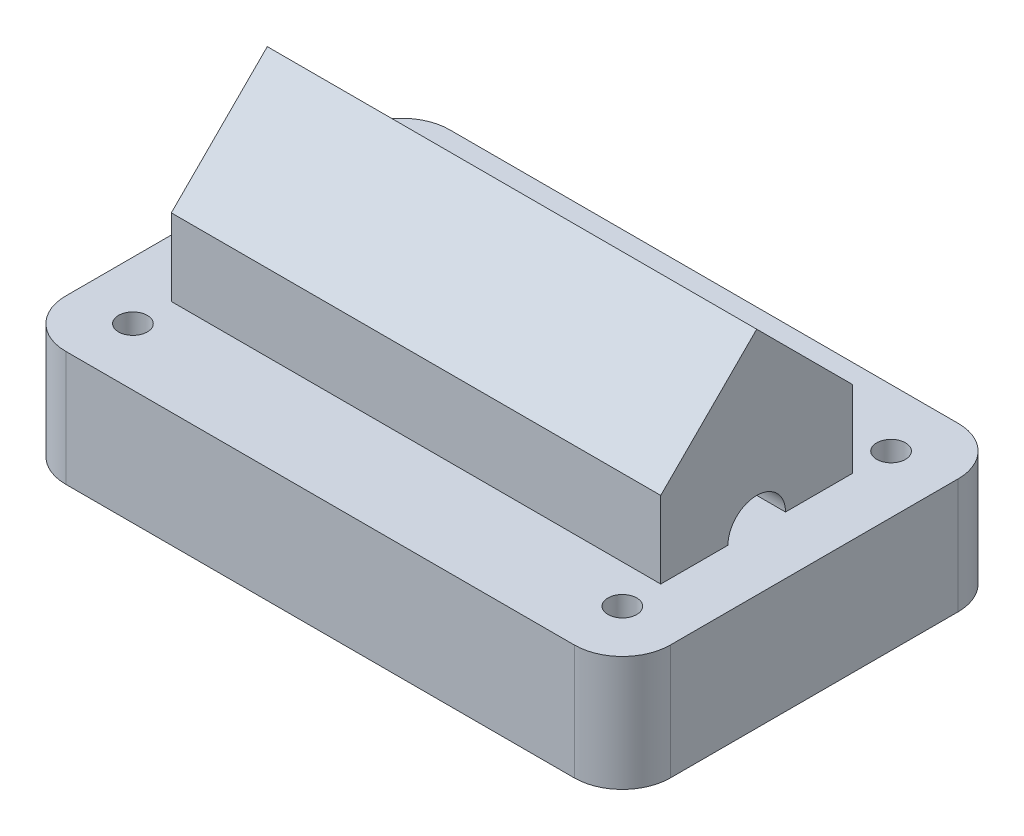
ISO-10303-21;
HEADER;
FILE_DESCRIPTION(('STEP AP214'),'2;1');
FILE_NAME('part.step','',(''),(''),'','','');
FILE_SCHEMA(('AUTOMOTIVE_DESIGN { 1 0 10303 214 1 1 1 1 }'));
ENDSEC;
DATA;
#1=APPLICATION_CONTEXT('core data for automotive mechanical design processes');
#2=APPLICATION_PROTOCOL_DEFINITION('international standard','automotive_design',2000,#1);
#3=PRODUCT_CONTEXT('',#1,'mechanical');
#4=PRODUCT('Part','Part','',(#3));
#5=PRODUCT_RELATED_PRODUCT_CATEGORY('part','',(#4));
#6=PRODUCT_DEFINITION_FORMATION('','',#4);
#7=PRODUCT_DEFINITION_CONTEXT('part definition',#1,'design');
#8=PRODUCT_DEFINITION('design','',#6,#7);
#9=PRODUCT_DEFINITION_SHAPE('','',#8);
#10=(LENGTH_UNIT() NAMED_UNIT(*) SI_UNIT(.MILLI.,.METRE.));
#11=(NAMED_UNIT(*) PLANE_ANGLE_UNIT() SI_UNIT($,.RADIAN.));
#12=(NAMED_UNIT(*) SI_UNIT($,.STERADIAN.) SOLID_ANGLE_UNIT());
#13=UNCERTAINTY_MEASURE_WITH_UNIT(LENGTH_MEASURE(1.E-05),#10,'distance_accuracy_value','');
#14=(GEOMETRIC_REPRESENTATION_CONTEXT(3) GLOBAL_UNCERTAINTY_ASSIGNED_CONTEXT((#13)) GLOBAL_UNIT_ASSIGNED_CONTEXT((#10,
#11,#12)) REPRESENTATION_CONTEXT('',''));
#15=CARTESIAN_POINT('',(0.,0.,0.));
#16=DIRECTION('',(0.,0.,1.));
#17=DIRECTION('',(1.,0.,0.));
#18=AXIS2_PLACEMENT_3D('',#15,#16,#17);
#19=CARTESIAN_POINT('',(0.,60.,0.));
#20=DIRECTION('',(0.,1.,0.));
#21=DIRECTION('',(0.,0.,1.));
#22=AXIS2_PLACEMENT_3D('',#19,#20,#21);
#23=PLANE('',#22);
#24=DIRECTION('',(0.,0.,1.));
#25=VECTOR('',#24,1.);
#26=CARTESIAN_POINT('',(-127.5,60.,-50.));
#27=LINE('',#26,#25);
#28=CARTESIAN_POINT('',(-127.5,60.,15.));
#29=VERTEX_POINT('',#28);
#30=CARTESIAN_POINT('',(-127.5,60.,50.));
#31=VERTEX_POINT('',#30);
#32=EDGE_CURVE('E468',#29,#31,#27,.T.);
#33=ORIENTED_EDGE('',*,*,#32,.F.);
#34=DIRECTION('',(1.,0.,0.));
#35=VECTOR('',#34,1.);
#36=CARTESIAN_POINT('',(-157.5,60.,15.));
#37=LINE('',#36,#35);
#38=CARTESIAN_POINT('',(127.5,60.,15.));
#39=VERTEX_POINT('',#38);
#40=EDGE_CURVE('E142',#29,#39,#37,.T.);
#41=ORIENTED_EDGE('',*,*,#40,.T.);
#42=DIRECTION('',(0.,0.,-1.));
#43=VECTOR('',#42,1.);
#44=CARTESIAN_POINT('',(127.5,60.,-50.));
#45=LINE('',#44,#43);
#46=CARTESIAN_POINT('',(127.5,60.,50.));
#47=VERTEX_POINT('',#46);
#48=EDGE_CURVE('E151',#47,#39,#45,.T.);
#49=ORIENTED_EDGE('',*,*,#48,.F.);
#50=DIRECTION('',(1.,0.,0.));
#51=VECTOR('',#50,1.);
#52=CARTESIAN_POINT('',(127.5,60.,50.));
#53=LINE('',#52,#51);
#54=EDGE_CURVE('E156',#31,#47,#53,.T.);
#55=ORIENTED_EDGE('',*,*,#54,.F.);
#56=EDGE_LOOP('',(#33,#41,#49,#55));
#57=FACE_BOUND('',#56,.T.);
#58=DIRECTION('',(0.,0.,1.));
#59=VECTOR('',#58,1.);
#60=CARTESIAN_POINT('',(-157.5,60.,-100.));
#61=LINE('',#60,#59);
#62=CARTESIAN_POINT('',(-157.5,60.,-75.));
#63=VERTEX_POINT('',#62);
#64=CARTESIAN_POINT('',(-157.5,60.,75.));
#65=VERTEX_POINT('',#64);
#66=EDGE_CURVE('E207',#63,#65,#61,.T.);
#67=ORIENTED_EDGE('',*,*,#66,.T.);
#68=CARTESIAN_POINT('',(-132.5,60.,75.));
#69=DIRECTION('',(0.,1.,0.));
#70=DIRECTION('',(0.,0.,1.));
#71=AXIS2_PLACEMENT_3D('',#68,#69,#70);
#72=CIRCLE('',#71,25.);
#73=CARTESIAN_POINT('',(-132.5,60.,100.));
#74=VERTEX_POINT('',#73);
#75=EDGE_CURVE('E245',#65,#74,#72,.T.);
#76=ORIENTED_EDGE('',*,*,#75,.T.);
#77=DIRECTION('',(1.,0.,0.));
#78=VECTOR('',#77,1.);
#79=CARTESIAN_POINT('',(-157.5,60.,100.));
#80=LINE('',#79,#78);
#81=CARTESIAN_POINT('',(132.5,60.,100.));
#82=VERTEX_POINT('',#81);
#83=EDGE_CURVE('E209',#74,#82,#80,.T.);
#84=ORIENTED_EDGE('',*,*,#83,.T.);
#85=CARTESIAN_POINT('',(132.5,60.,75.));
#86=DIRECTION('',(0.,1.,0.));
#87=DIRECTION('',(0.,0.,1.));
#88=AXIS2_PLACEMENT_3D('',#85,#86,#87);
#89=CIRCLE('',#88,25.);
#90=CARTESIAN_POINT('',(157.5,60.,75.));
#91=VERTEX_POINT('',#90);
#92=EDGE_CURVE('E241',#82,#91,#89,.T.);
#93=ORIENTED_EDGE('',*,*,#92,.T.);
#94=DIRECTION('',(0.,0.,-1.));
#95=VECTOR('',#94,1.);
#96=CARTESIAN_POINT('',(157.5,60.,-100.));
#97=LINE('',#96,#95);
#98=CARTESIAN_POINT('',(157.5,60.,-75.));
#99=VERTEX_POINT('',#98);
#100=EDGE_CURVE('E200',#91,#99,#97,.T.);
#101=ORIENTED_EDGE('',*,*,#100,.T.);
#102=CARTESIAN_POINT('',(132.5,60.,-75.));
#103=DIRECTION('',(0.,1.,0.));
#104=DIRECTION('',(0.,0.,1.));
#105=AXIS2_PLACEMENT_3D('',#102,#103,#104);
#106=CIRCLE('',#105,25.);
#107=CARTESIAN_POINT('',(132.5,60.,-100.));
#108=VERTEX_POINT('',#107);
#109=EDGE_CURVE('E243',#99,#108,#106,.T.);
#110=ORIENTED_EDGE('',*,*,#109,.T.);
#111=DIRECTION('',(-1.,0.,0.));
#112=VECTOR('',#111,1.);
#113=CARTESIAN_POINT('',(-157.5,60.,-100.));
#114=LINE('',#113,#112);
#115=CARTESIAN_POINT('',(-132.5,60.,-100.));
#116=VERTEX_POINT('',#115);
#117=EDGE_CURVE('E203',#108,#116,#114,.T.);
#118=ORIENTED_EDGE('',*,*,#117,.T.);
#119=CARTESIAN_POINT('',(-132.5,60.,-75.));
#120=DIRECTION('',(0.,1.,0.));
#121=DIRECTION('',(0.,0.,1.));
#122=AXIS2_PLACEMENT_3D('',#119,#120,#121);
#123=CIRCLE('',#122,25.);
#124=EDGE_CURVE('E247',#116,#63,#123,.T.);
#125=ORIENTED_EDGE('',*,*,#124,.T.);
#126=EDGE_LOOP('',(#67,#76,#84,#93,#101,#110,#118,#125));
#127=FACE_BOUND('',#126,.T.);
#128=DIRECTION('',(1.,0.,0.));
#129=VECTOR('',#128,1.);
#130=CARTESIAN_POINT('',(-157.5,60.,-15.));
#131=LINE('',#130,#129);
#132=CARTESIAN_POINT('',(-127.5,60.,-15.));
#133=VERTEX_POINT('',#132);
#134=CARTESIAN_POINT('',(127.5,60.,-15.));
#135=VERTEX_POINT('',#134);
#136=EDGE_CURVE('E49',#133,#135,#131,.T.);
#137=ORIENTED_EDGE('',*,*,#136,.F.);
#138=CARTESIAN_POINT('',(-127.5,60.,-50.));
#139=VERTEX_POINT('',#138);
#140=EDGE_CURVE('E158',#139,#133,#27,.T.);
#141=ORIENTED_EDGE('',*,*,#140,.F.);
#142=DIRECTION('',(-1.,0.,0.));
#143=VECTOR('',#142,1.);
#144=CARTESIAN_POINT('',(127.5,60.,-50.));
#145=LINE('',#144,#143);
#146=CARTESIAN_POINT('',(127.5,60.,-50.));
#147=VERTEX_POINT('',#146);
#148=EDGE_CURVE('E155',#147,#139,#145,.T.);
#149=ORIENTED_EDGE('',*,*,#148,.F.);
#150=EDGE_CURVE('E147',#135,#147,#45,.T.);
#151=ORIENTED_EDGE('',*,*,#150,.F.);
#152=EDGE_LOOP('',(#137,#141,#149,#151));
#153=FACE_BOUND('',#152,.T.);
#154=CARTESIAN_POINT('',(-127.5,60.,70.));
#155=DIRECTION('',(0.,1.,0.));
#156=DIRECTION('',(0.,0.,-1.));
#157=AXIS2_PLACEMENT_3D('',#154,#155,#156);
#158=CIRCLE('',#157,7.50000000000001);
#159=CARTESIAN_POINT('',(-127.5,60.,62.5));
#160=VERTEX_POINT('',#159);
#161=EDGE_CURVE('E175',#160,#160,#158,.T.);
#162=ORIENTED_EDGE('',*,*,#161,.F.);
#163=EDGE_LOOP('',(#162));
#164=FACE_BOUND('',#163,.T.);
#165=CARTESIAN_POINT('',(127.5,60.,70.));
#166=DIRECTION('',(0.,1.,0.));
#167=DIRECTION('',(0.,0.,1.));
#168=AXIS2_PLACEMENT_3D('',#165,#166,#167);
#169=CIRCLE('',#168,7.50000000000001);
#170=CARTESIAN_POINT('',(127.5,60.,77.5));
#171=VERTEX_POINT('',#170);
#172=EDGE_CURVE('E186',#171,#171,#169,.T.);
#173=ORIENTED_EDGE('',*,*,#172,.F.);
#174=EDGE_LOOP('',(#173));
#175=FACE_BOUND('',#174,.T.);
#176=CARTESIAN_POINT('',(127.5,60.,-70.));
#177=DIRECTION('',(0.,1.,0.));
#178=DIRECTION('',(0.,0.,-1.));
#179=AXIS2_PLACEMENT_3D('',#176,#177,#178);
#180=CIRCLE('',#179,7.50000000000001);
#181=CARTESIAN_POINT('',(127.5,60.,-77.5));
#182=VERTEX_POINT('',#181);
#183=EDGE_CURVE('E180',#182,#182,#180,.T.);
#184=ORIENTED_EDGE('',*,*,#183,.F.);
#185=EDGE_LOOP('',(#184));
#186=FACE_BOUND('',#185,.T.);
#187=CARTESIAN_POINT('',(-127.5,60.,-70.));
#188=DIRECTION('',(0.,1.,0.));
#189=DIRECTION('',(0.,0.,1.));
#190=AXIS2_PLACEMENT_3D('',#187,#188,#189);
#191=CIRCLE('',#190,7.50000000000001);
#192=CARTESIAN_POINT('',(-127.5,60.,-62.5));
#193=VERTEX_POINT('',#192);
#194=EDGE_CURVE('E179',#193,#193,#191,.T.);
#195=ORIENTED_EDGE('',*,*,#194,.F.);
#196=EDGE_LOOP('',(#195));
#197=FACE_BOUND('',#196,.T.);
#198=ADVANCED_FACE('F34',(#57,#127,#153,#164,#175,#186,#197),#23,.T.);
#199=CARTESIAN_POINT('',(157.5,60.,-100.));
#200=DIRECTION('',(-1.,0.,0.));
#201=DIRECTION('',(0.,0.,1.));
#202=AXIS2_PLACEMENT_3D('',#199,#200,#201);
#203=PLANE('',#202);
#204=DIRECTION('',(0.,0.,-1.));
#205=VECTOR('',#204,1.);
#206=CARTESIAN_POINT('',(157.5,0.,-100.));
#207=LINE('',#206,#205);
#208=CARTESIAN_POINT('',(157.5,0.,75.));
#209=VERTEX_POINT('',#208);
#210=CARTESIAN_POINT('',(157.5,0.,-75.));
#211=VERTEX_POINT('',#210);
#212=EDGE_CURVE('E197',#209,#211,#207,.T.);
#213=ORIENTED_EDGE('',*,*,#212,.T.);
#214=DIRECTION('',(0.,-1.,0.));
#215=VECTOR('',#214,1.);
#216=CARTESIAN_POINT('',(157.5,60.,-75.));
#217=LINE('',#216,#215);
#218=EDGE_CURVE('E11',#211,#99,#217,.F.);
#219=ORIENTED_EDGE('',*,*,#218,.T.);
#220=ORIENTED_EDGE('',*,*,#100,.F.);
#221=DIRECTION('',(0.,-1.,0.));
#222=VECTOR('',#221,1.);
#223=CARTESIAN_POINT('',(157.5,60.,75.));
#224=LINE('',#223,#222);
#225=EDGE_CURVE('E42',#91,#209,#224,.T.);
#226=ORIENTED_EDGE('',*,*,#225,.T.);
#227=EDGE_LOOP('',(#213,#219,#220,#226));
#228=FACE_BOUND('',#227,.T.);
#229=ADVANCED_FACE('F258',(#228),#203,.F.);
#230=CARTESIAN_POINT('',(-157.5,60.,-100.));
#231=DIRECTION('',(0.,0.,1.));
#232=DIRECTION('',(1.,0.,0.));
#233=AXIS2_PLACEMENT_3D('',#230,#231,#232);
#234=PLANE('',#233);
#235=DIRECTION('',(-1.,0.,0.));
#236=VECTOR('',#235,1.);
#237=CARTESIAN_POINT('',(-157.5,0.,-100.));
#238=LINE('',#237,#236);
#239=CARTESIAN_POINT('',(132.5,0.,-100.));
#240=VERTEX_POINT('',#239);
#241=CARTESIAN_POINT('',(-132.5,0.,-100.));
#242=VERTEX_POINT('',#241);
#243=EDGE_CURVE('E215',#240,#242,#238,.T.);
#244=ORIENTED_EDGE('',*,*,#243,.T.);
#245=DIRECTION('',(0.,-1.,0.));
#246=VECTOR('',#245,1.);
#247=CARTESIAN_POINT('',(-132.5,60.,-100.));
#248=LINE('',#247,#246);
#249=EDGE_CURVE('E239',#242,#116,#248,.F.);
#250=ORIENTED_EDGE('',*,*,#249,.T.);
#251=ORIENTED_EDGE('',*,*,#117,.F.);
#252=DIRECTION('',(0.,-1.,0.));
#253=VECTOR('',#252,1.);
#254=CARTESIAN_POINT('',(132.5,60.,-100.));
#255=LINE('',#254,#253);
#256=EDGE_CURVE('E236',#108,#240,#255,.T.);
#257=ORIENTED_EDGE('',*,*,#256,.T.);
#258=EDGE_LOOP('',(#244,#250,#251,#257));
#259=FACE_BOUND('',#258,.T.);
#260=ADVANCED_FACE('F273',(#259),#234,.F.);
#261=CARTESIAN_POINT('',(-157.5,60.,-100.));
#262=DIRECTION('',(1.,0.,0.));
#263=DIRECTION('',(0.,0.,-1.));
#264=AXIS2_PLACEMENT_3D('',#261,#262,#263);
#265=PLANE('',#264);
#266=ORIENTED_EDGE('',*,*,#66,.F.);
#267=DIRECTION('',(0.,-1.,0.));
#268=VECTOR('',#267,1.);
#269=CARTESIAN_POINT('',(-157.5,60.,-75.));
#270=LINE('',#269,#268);
#271=CARTESIAN_POINT('',(-157.5,0.,-75.));
#272=VERTEX_POINT('',#271);
#273=EDGE_CURVE('E225',#63,#272,#270,.T.);
#274=ORIENTED_EDGE('',*,*,#273,.T.);
#275=DIRECTION('',(0.,0.,1.));
#276=VECTOR('',#275,1.);
#277=CARTESIAN_POINT('',(-157.5,0.,-100.));
#278=LINE('',#277,#276);
#279=CARTESIAN_POINT('',(-157.5,0.,75.));
#280=VERTEX_POINT('',#279);
#281=EDGE_CURVE('E218',#272,#280,#278,.T.);
#282=ORIENTED_EDGE('',*,*,#281,.T.);
#283=DIRECTION('',(0.,-1.,0.));
#284=VECTOR('',#283,1.);
#285=CARTESIAN_POINT('',(-157.5,60.,75.));
#286=LINE('',#285,#284);
#287=EDGE_CURVE('E212',#280,#65,#286,.F.);
#288=ORIENTED_EDGE('',*,*,#287,.T.);
#289=EDGE_LOOP('',(#266,#274,#282,#288));
#290=FACE_BOUND('',#289,.T.);
#291=ADVANCED_FACE('F282',(#290),#265,.F.);
#292=CARTESIAN_POINT('',(-157.5,60.,100.));
#293=DIRECTION('',(0.,0.,-1.));
#294=DIRECTION('',(-1.,0.,0.));
#295=AXIS2_PLACEMENT_3D('',#292,#293,#294);
#296=PLANE('',#295);
#297=ORIENTED_EDGE('',*,*,#83,.F.);
#298=DIRECTION('',(0.,-1.,0.));
#299=VECTOR('',#298,1.);
#300=CARTESIAN_POINT('',(-132.5,60.,100.));
#301=LINE('',#300,#299);
#302=CARTESIAN_POINT('',(-132.5,0.,100.));
#303=VERTEX_POINT('',#302);
#304=EDGE_CURVE('E251',#74,#303,#301,.T.);
#305=ORIENTED_EDGE('',*,*,#304,.T.);
#306=DIRECTION('',(1.,0.,0.));
#307=VECTOR('',#306,1.);
#308=CARTESIAN_POINT('',(-157.5,0.,100.));
#309=LINE('',#308,#307);
#310=CARTESIAN_POINT('',(132.5,0.,100.));
#311=VERTEX_POINT('',#310);
#312=EDGE_CURVE('E204',#303,#311,#309,.T.);
#313=ORIENTED_EDGE('',*,*,#312,.T.);
#314=DIRECTION('',(0.,-1.,0.));
#315=VECTOR('',#314,1.);
#316=CARTESIAN_POINT('',(132.5,60.,100.));
#317=LINE('',#316,#315);
#318=EDGE_CURVE('E249',#311,#82,#317,.F.);
#319=ORIENTED_EDGE('',*,*,#318,.T.);
#320=EDGE_LOOP('',(#297,#305,#313,#319));
#321=FACE_BOUND('',#320,.T.);
#322=ADVANCED_FACE('F290',(#321),#296,.F.);
#323=CARTESIAN_POINT('',(0.,0.,0.));
#324=DIRECTION('',(0.,1.,0.));
#325=DIRECTION('',(0.,0.,1.));
#326=AXIS2_PLACEMENT_3D('',#323,#324,#325);
#327=PLANE('',#326);
#328=CARTESIAN_POINT('',(-127.5,0.,70.));
#329=DIRECTION('',(0.,1.,0.));
#330=DIRECTION('',(0.,0.,-1.));
#331=AXIS2_PLACEMENT_3D('',#328,#329,#330);
#332=CIRCLE('',#331,7.50000000000001);
#333=CARTESIAN_POINT('',(-127.5,0.,62.5));
#334=VERTEX_POINT('',#333);
#335=EDGE_CURVE('E189',#334,#334,#332,.T.);
#336=ORIENTED_EDGE('',*,*,#335,.T.);
#337=EDGE_LOOP('',(#336));
#338=FACE_BOUND('',#337,.T.);
#339=CARTESIAN_POINT('',(127.5,0.,70.));
#340=DIRECTION('',(0.,1.,0.));
#341=DIRECTION('',(0.,0.,1.));
#342=AXIS2_PLACEMENT_3D('',#339,#340,#341);
#343=CIRCLE('',#342,7.50000000000001);
#344=CARTESIAN_POINT('',(127.5,0.,77.5));
#345=VERTEX_POINT('',#344);
#346=EDGE_CURVE('E183',#345,#345,#343,.T.);
#347=ORIENTED_EDGE('',*,*,#346,.T.);
#348=EDGE_LOOP('',(#347));
#349=FACE_BOUND('',#348,.T.);
#350=CARTESIAN_POINT('',(127.5,0.,-70.));
#351=DIRECTION('',(0.,1.,0.));
#352=DIRECTION('',(0.,0.,-1.));
#353=AXIS2_PLACEMENT_3D('',#350,#351,#352);
#354=CIRCLE('',#353,7.50000000000001);
#355=CARTESIAN_POINT('',(127.5,0.,-77.5));
#356=VERTEX_POINT('',#355);
#357=EDGE_CURVE('E176',#356,#356,#354,.T.);
#358=ORIENTED_EDGE('',*,*,#357,.T.);
#359=EDGE_LOOP('',(#358));
#360=FACE_BOUND('',#359,.T.);
#361=CARTESIAN_POINT('',(-127.5,0.,-70.));
#362=DIRECTION('',(0.,1.,0.));
#363=DIRECTION('',(0.,0.,1.));
#364=AXIS2_PLACEMENT_3D('',#361,#362,#363);
#365=CIRCLE('',#364,7.50000000000001);
#366=CARTESIAN_POINT('',(-127.5,0.,-62.5));
#367=VERTEX_POINT('',#366);
#368=EDGE_CURVE('E194',#367,#367,#365,.T.);
#369=ORIENTED_EDGE('',*,*,#368,.T.);
#370=EDGE_LOOP('',(#369));
#371=FACE_BOUND('',#370,.T.);
#372=ORIENTED_EDGE('',*,*,#281,.F.);
#373=CARTESIAN_POINT('',(-132.5,0.,-75.));
#374=DIRECTION('',(0.,1.,0.));
#375=DIRECTION('',(0.,0.,1.));
#376=AXIS2_PLACEMENT_3D('',#373,#374,#375);
#377=CIRCLE('',#376,25.);
#378=EDGE_CURVE('E234',#272,#242,#377,.F.);
#379=ORIENTED_EDGE('',*,*,#378,.T.);
#380=ORIENTED_EDGE('',*,*,#243,.F.);
#381=CARTESIAN_POINT('',(132.5,0.,-75.));
#382=DIRECTION('',(0.,1.,0.));
#383=DIRECTION('',(0.,0.,1.));
#384=AXIS2_PLACEMENT_3D('',#381,#382,#383);
#385=CIRCLE('',#384,25.);
#386=EDGE_CURVE('E230',#240,#211,#385,.F.);
#387=ORIENTED_EDGE('',*,*,#386,.T.);
#388=ORIENTED_EDGE('',*,*,#212,.F.);
#389=CARTESIAN_POINT('',(132.5,0.,75.));
#390=DIRECTION('',(0.,1.,0.));
#391=DIRECTION('',(0.,0.,1.));
#392=AXIS2_PLACEMENT_3D('',#389,#390,#391);
#393=CIRCLE('',#392,25.);
#394=EDGE_CURVE('E228',#209,#311,#393,.F.);
#395=ORIENTED_EDGE('',*,*,#394,.T.);
#396=ORIENTED_EDGE('',*,*,#312,.F.);
#397=CARTESIAN_POINT('',(-132.5,0.,75.));
#398=DIRECTION('',(0.,1.,0.));
#399=DIRECTION('',(0.,0.,1.));
#400=AXIS2_PLACEMENT_3D('',#397,#398,#399);
#401=CIRCLE('',#400,25.);
#402=EDGE_CURVE('E232',#303,#280,#401,.F.);
#403=ORIENTED_EDGE('',*,*,#402,.T.);
#404=EDGE_LOOP('',(#372,#379,#380,#387,#388,#395,#396,#403));
#405=FACE_BOUND('',#404,.T.);
#406=ADVANCED_FACE('F264',(#338,#349,#360,#371,#405),#327,.F.);
#407=CARTESIAN_POINT('',(-132.5,60.,-75.));
#408=DIRECTION('',(0.,-1.,0.));
#409=DIRECTION('',(0.,0.,-1.));
#410=AXIS2_PLACEMENT_3D('',#407,#408,#409);
#411=CYLINDRICAL_SURFACE('',#410,25.);
#412=ORIENTED_EDGE('',*,*,#124,.F.);
#413=ORIENTED_EDGE('',*,*,#249,.F.);
#414=ORIENTED_EDGE('',*,*,#378,.F.);
#415=ORIENTED_EDGE('',*,*,#273,.F.);
#416=EDGE_LOOP('',(#412,#413,#414,#415));
#417=FACE_BOUND('',#416,.T.);
#418=ADVANCED_FACE('F280',(#417),#411,.T.);
#419=CARTESIAN_POINT('',(-132.5,60.,75.));
#420=DIRECTION('',(0.,-1.,0.));
#421=DIRECTION('',(0.,0.,-1.));
#422=AXIS2_PLACEMENT_3D('',#419,#420,#421);
#423=CYLINDRICAL_SURFACE('',#422,25.);
#424=ORIENTED_EDGE('',*,*,#75,.F.);
#425=ORIENTED_EDGE('',*,*,#287,.F.);
#426=ORIENTED_EDGE('',*,*,#402,.F.);
#427=ORIENTED_EDGE('',*,*,#304,.F.);
#428=EDGE_LOOP('',(#424,#425,#426,#427));
#429=FACE_BOUND('',#428,.T.);
#430=ADVANCED_FACE('F287',(#429),#423,.T.);
#431=CARTESIAN_POINT('',(132.5,60.,-75.));
#432=DIRECTION('',(0.,-1.,0.));
#433=DIRECTION('',(0.,0.,-1.));
#434=AXIS2_PLACEMENT_3D('',#431,#432,#433);
#435=CYLINDRICAL_SURFACE('',#434,25.);
#436=ORIENTED_EDGE('',*,*,#109,.F.);
#437=ORIENTED_EDGE('',*,*,#218,.F.);
#438=ORIENTED_EDGE('',*,*,#386,.F.);
#439=ORIENTED_EDGE('',*,*,#256,.F.);
#440=EDGE_LOOP('',(#436,#437,#438,#439));
#441=FACE_BOUND('',#440,.T.);
#442=ADVANCED_FACE('F270',(#441),#435,.T.);
#443=CARTESIAN_POINT('',(132.5,60.,75.));
#444=DIRECTION('',(0.,-1.,0.));
#445=DIRECTION('',(0.,0.,-1.));
#446=AXIS2_PLACEMENT_3D('',#443,#444,#445);
#447=CYLINDRICAL_SURFACE('',#446,25.);
#448=ORIENTED_EDGE('',*,*,#92,.F.);
#449=ORIENTED_EDGE('',*,*,#318,.F.);
#450=ORIENTED_EDGE('',*,*,#394,.F.);
#451=ORIENTED_EDGE('',*,*,#225,.F.);
#452=EDGE_LOOP('',(#448,#449,#450,#451));
#453=FACE_BOUND('',#452,.T.);
#454=ADVANCED_FACE('F36',(#453),#447,.T.);
#455=CARTESIAN_POINT('',(-127.5,0.,-70.));
#456=DIRECTION('',(0.,1.,0.));
#457=DIRECTION('',(0.,0.,1.));
#458=AXIS2_PLACEMENT_3D('',#455,#456,#457);
#459=CYLINDRICAL_SURFACE('',#458,7.50000000000001);
#460=ORIENTED_EDGE('',*,*,#368,.F.);
#461=EDGE_LOOP('',(#460));
#462=FACE_BOUND('',#461,.T.);
#463=ORIENTED_EDGE('',*,*,#194,.T.);
#464=EDGE_LOOP('',(#463));
#465=FACE_BOUND('',#464,.T.);
#466=ADVANCED_FACE('F293',(#462,#465),#459,.F.);
#467=CARTESIAN_POINT('',(127.5,0.,-70.));
#468=DIRECTION('',(0.,1.,0.));
#469=DIRECTION('',(0.,0.,1.));
#470=AXIS2_PLACEMENT_3D('',#467,#468,#469);
#471=CYLINDRICAL_SURFACE('',#470,7.50000000000001);
#472=ORIENTED_EDGE('',*,*,#357,.F.);
#473=EDGE_LOOP('',(#472));
#474=FACE_BOUND('',#473,.T.);
#475=ORIENTED_EDGE('',*,*,#183,.T.);
#476=EDGE_LOOP('',(#475));
#477=FACE_BOUND('',#476,.T.);
#478=ADVANCED_FACE('F298',(#474,#477),#471,.F.);
#479=CARTESIAN_POINT('',(127.5,0.,70.));
#480=DIRECTION('',(0.,1.,0.));
#481=DIRECTION('',(0.,0.,1.));
#482=AXIS2_PLACEMENT_3D('',#479,#480,#481);
#483=CYLINDRICAL_SURFACE('',#482,7.50000000000001);
#484=ORIENTED_EDGE('',*,*,#346,.F.);
#485=EDGE_LOOP('',(#484));
#486=FACE_BOUND('',#485,.T.);
#487=ORIENTED_EDGE('',*,*,#172,.T.);
#488=EDGE_LOOP('',(#487));
#489=FACE_BOUND('',#488,.T.);
#490=ADVANCED_FACE('F358',(#486,#489),#483,.F.);
#491=CARTESIAN_POINT('',(-127.5,0.,70.));
#492=DIRECTION('',(0.,1.,0.));
#493=DIRECTION('',(0.,0.,1.));
#494=AXIS2_PLACEMENT_3D('',#491,#492,#493);
#495=CYLINDRICAL_SURFACE('',#494,7.50000000000001);
#496=ORIENTED_EDGE('',*,*,#335,.F.);
#497=EDGE_LOOP('',(#496));
#498=FACE_BOUND('',#497,.T.);
#499=ORIENTED_EDGE('',*,*,#161,.T.);
#500=EDGE_LOOP('',(#499));
#501=FACE_BOUND('',#500,.T.);
#502=ADVANCED_FACE('F368',(#498,#501),#495,.F.);
#503=CARTESIAN_POINT('',(-127.5,100.,-50.));
#504=DIRECTION('',(1.,0.,0.));
#505=DIRECTION('',(0.,0.,-1.));
#506=AXIS2_PLACEMENT_3D('',#503,#504,#505);
#507=PLANE('',#506);
#508=ORIENTED_EDGE('',*,*,#140,.T.);
#509=CARTESIAN_POINT('',(-127.5,60.,0.));
#510=DIRECTION('',(1.,0.,0.));
#511=DIRECTION('',(0.,0.,-1.));
#512=AXIS2_PLACEMENT_3D('',#509,#510,#511);
#513=CIRCLE('',#512,15.);
#514=EDGE_CURVE('E140',#133,#29,#513,.T.);
#515=ORIENTED_EDGE('',*,*,#514,.T.);
#516=ORIENTED_EDGE('',*,*,#32,.T.);
#517=DIRECTION('',(0.,-1.,0.));
#518=VECTOR('',#517,1.);
#519=CARTESIAN_POINT('',(-127.5,100.,50.));
#520=LINE('',#519,#518);
#521=CARTESIAN_POINT('',(-127.5,100.,50.));
#522=VERTEX_POINT('',#521);
#523=EDGE_CURVE('E172',#522,#31,#520,.T.);
#524=ORIENTED_EDGE('',*,*,#523,.F.);
#525=DIRECTION('',(0.,0.707106781186549,-0.707106781186546));
#526=VECTOR('',#525,1.);
#527=CARTESIAN_POINT('',(-127.5,100.,50.));
#528=LINE('',#527,#526);
#529=CARTESIAN_POINT('',(-127.5,150.,0.));
#530=VERTEX_POINT('',#529);
#531=EDGE_CURVE('E476',#522,#530,#528,.T.);
#532=ORIENTED_EDGE('',*,*,#531,.T.);
#533=DIRECTION('',(0.,-0.707106781186549,-0.707106781186547));
#534=VECTOR('',#533,1.);
#535=CARTESIAN_POINT('',(-127.5,150.,0.));
#536=LINE('',#535,#534);
#537=CARTESIAN_POINT('',(-127.5,100.,-50.));
#538=VERTEX_POINT('',#537);
#539=EDGE_CURVE('E469',#530,#538,#536,.T.);
#540=ORIENTED_EDGE('',*,*,#539,.T.);
#541=DIRECTION('',(0.,-1.,0.));
#542=VECTOR('',#541,1.);
#543=CARTESIAN_POINT('',(-127.5,100.,-50.));
#544=LINE('',#543,#542);
#545=EDGE_CURVE('E164',#538,#139,#544,.T.);
#546=ORIENTED_EDGE('',*,*,#545,.T.);
#547=EDGE_LOOP('',(#508,#515,#516,#524,#532,#540,#546));
#548=FACE_BOUND('',#547,.T.);
#549=ADVANCED_FACE('F378',(#548),#507,.F.);
#550=CARTESIAN_POINT('',(127.5,100.,50.));
#551=DIRECTION('',(0.,0.,-1.));
#552=DIRECTION('',(-1.,0.,0.));
#553=AXIS2_PLACEMENT_3D('',#550,#551,#552);
#554=PLANE('',#553);
#555=ORIENTED_EDGE('',*,*,#54,.T.);
#556=DIRECTION('',(0.,-1.,0.));
#557=VECTOR('',#556,1.);
#558=CARTESIAN_POINT('',(127.5,100.,50.));
#559=LINE('',#558,#557);
#560=CARTESIAN_POINT('',(127.5,100.,50.));
#561=VERTEX_POINT('',#560);
#562=EDGE_CURVE('E170',#561,#47,#559,.T.);
#563=ORIENTED_EDGE('',*,*,#562,.F.);
#564=DIRECTION('',(1.,0.,0.));
#565=VECTOR('',#564,1.);
#566=CARTESIAN_POINT('',(127.5,100.,50.));
#567=LINE('',#566,#565);
#568=EDGE_CURVE('E163',#522,#561,#567,.T.);
#569=ORIENTED_EDGE('',*,*,#568,.F.);
#570=ORIENTED_EDGE('',*,*,#523,.T.);
#571=EDGE_LOOP('',(#555,#563,#569,#570));
#572=FACE_BOUND('',#571,.T.);
#573=ADVANCED_FACE('F385',(#572),#554,.F.);
#574=CARTESIAN_POINT('',(127.5,100.,-50.));
#575=DIRECTION('',(-1.,0.,0.));
#576=DIRECTION('',(0.,0.,1.));
#577=AXIS2_PLACEMENT_3D('',#574,#575,#576);
#578=PLANE('',#577);
#579=ORIENTED_EDGE('',*,*,#48,.T.);
#580=CARTESIAN_POINT('',(127.5,60.,0.));
#581=DIRECTION('',(1.,0.,0.));
#582=DIRECTION('',(0.,0.,-1.));
#583=AXIS2_PLACEMENT_3D('',#580,#581,#582);
#584=CIRCLE('',#583,15.);
#585=EDGE_CURVE('E56',#135,#39,#584,.T.);
#586=ORIENTED_EDGE('',*,*,#585,.F.);
#587=ORIENTED_EDGE('',*,*,#150,.T.);
#588=DIRECTION('',(0.,-1.,0.));
#589=VECTOR('',#588,1.);
#590=CARTESIAN_POINT('',(127.5,100.,-50.));
#591=LINE('',#590,#589);
#592=CARTESIAN_POINT('',(127.5,100.,-50.));
#593=VERTEX_POINT('',#592);
#594=EDGE_CURVE('E167',#593,#147,#591,.T.);
#595=ORIENTED_EDGE('',*,*,#594,.F.);
#596=DIRECTION('',(0.,0.707106781186548,0.707106781186546));
#597=VECTOR('',#596,1.);
#598=CARTESIAN_POINT('',(127.5,150.,0.));
#599=LINE('',#598,#597);
#600=CARTESIAN_POINT('',(127.5,150.,0.));
#601=VERTEX_POINT('',#600);
#602=EDGE_CURVE('E482',#593,#601,#599,.T.);
#603=ORIENTED_EDGE('',*,*,#602,.T.);
#604=DIRECTION('',(0.,-0.707106781186549,0.707106781186546));
#605=VECTOR('',#604,1.);
#606=CARTESIAN_POINT('',(127.5,100.,50.));
#607=LINE('',#606,#605);
#608=EDGE_CURVE('E479',#601,#561,#607,.T.);
#609=ORIENTED_EDGE('',*,*,#608,.T.);
#610=ORIENTED_EDGE('',*,*,#562,.T.);
#611=EDGE_LOOP('',(#579,#586,#587,#595,#603,#609,#610));
#612=FACE_BOUND('',#611,.T.);
#613=ADVANCED_FACE('F146',(#612),#578,.F.);
#614=CARTESIAN_POINT('',(127.5,100.,-50.));
#615=DIRECTION('',(0.,0.,1.));
#616=DIRECTION('',(1.,0.,0.));
#617=AXIS2_PLACEMENT_3D('',#614,#615,#616);
#618=PLANE('',#617);
#619=ORIENTED_EDGE('',*,*,#148,.T.);
#620=ORIENTED_EDGE('',*,*,#545,.F.);
#621=DIRECTION('',(-1.,0.,0.));
#622=VECTOR('',#621,1.);
#623=CARTESIAN_POINT('',(127.5,100.,-50.));
#624=LINE('',#623,#622);
#625=EDGE_CURVE('E168',#593,#538,#624,.T.);
#626=ORIENTED_EDGE('',*,*,#625,.F.);
#627=ORIENTED_EDGE('',*,*,#594,.T.);
#628=EDGE_LOOP('',(#619,#620,#626,#627));
#629=FACE_BOUND('',#628,.T.);
#630=ADVANCED_FACE('F398',(#629),#618,.F.);
#631=CARTESIAN_POINT('',(-239.30339887499,100.,50.));
#632=DIRECTION('',(0.,0.707106781186546,0.707106781186549));
#633=DIRECTION('',(0.,-0.707106781186549,0.707106781186546));
#634=AXIS2_PLACEMENT_3D('',#631,#632,#633);
#635=PLANE('',#634);
#636=ORIENTED_EDGE('',*,*,#531,.F.);
#637=ORIENTED_EDGE('',*,*,#568,.T.);
#638=ORIENTED_EDGE('',*,*,#608,.F.);
#639=DIRECTION('',(1.,0.,0.));
#640=VECTOR('',#639,1.);
#641=CARTESIAN_POINT('',(-239.30339887499,150.,0.));
#642=LINE('',#641,#640);
#643=EDGE_CURVE('E477',#530,#601,#642,.T.);
#644=ORIENTED_EDGE('',*,*,#643,.F.);
#645=EDGE_LOOP('',(#636,#637,#638,#644));
#646=FACE_BOUND('',#645,.T.);
#647=ADVANCED_FACE('F403',(#646),#635,.T.);
#648=CARTESIAN_POINT('',(-239.30339887499,150.,0.));
#649=DIRECTION('',(0.,0.707106781186546,-0.707106781186548));
#650=DIRECTION('',(0.,0.707106781186549,0.707106781186547));
#651=AXIS2_PLACEMENT_3D('',#648,#649,#650);
#652=PLANE('',#651);
#653=ORIENTED_EDGE('',*,*,#539,.F.);
#654=ORIENTED_EDGE('',*,*,#643,.T.);
#655=ORIENTED_EDGE('',*,*,#602,.F.);
#656=ORIENTED_EDGE('',*,*,#625,.T.);
#657=EDGE_LOOP('',(#653,#654,#655,#656));
#658=FACE_BOUND('',#657,.T.);
#659=ADVANCED_FACE('F414',(#658),#652,.T.);
#660=CARTESIAN_POINT('',(-157.5,60.,0.));
#661=DIRECTION('',(1.,0.,0.));
#662=DIRECTION('',(0.,0.,-1.));
#663=AXIS2_PLACEMENT_3D('',#660,#661,#662);
#664=CYLINDRICAL_SURFACE('',#663,15.);
#665=ORIENTED_EDGE('',*,*,#136,.T.);
#666=ORIENTED_EDGE('',*,*,#585,.T.);
#667=ORIENTED_EDGE('',*,*,#40,.F.);
#668=ORIENTED_EDGE('',*,*,#514,.F.);
#669=EDGE_LOOP('',(#665,#666,#667,#668));
#670=FACE_BOUND('',#669,.T.);
#671=ADVANCED_FACE('F138',(#670),#664,.F.);
#672=CLOSED_SHELL('',(#198,#229,#260,#291,#322,#406,#418,#430,#442,#454,#466,#478,#490,#502,
#549,#573,#613,#630,#647,#659,#671));
#673=MANIFOLD_SOLID_BREP('B2',#672);
#674=ADVANCED_BREP_SHAPE_REPRESENTATION('',(#18,#673),#14);
#675=SHAPE_DEFINITION_REPRESENTATION(#9,#674);
ENDSEC;
END-ISO-10303-21;
